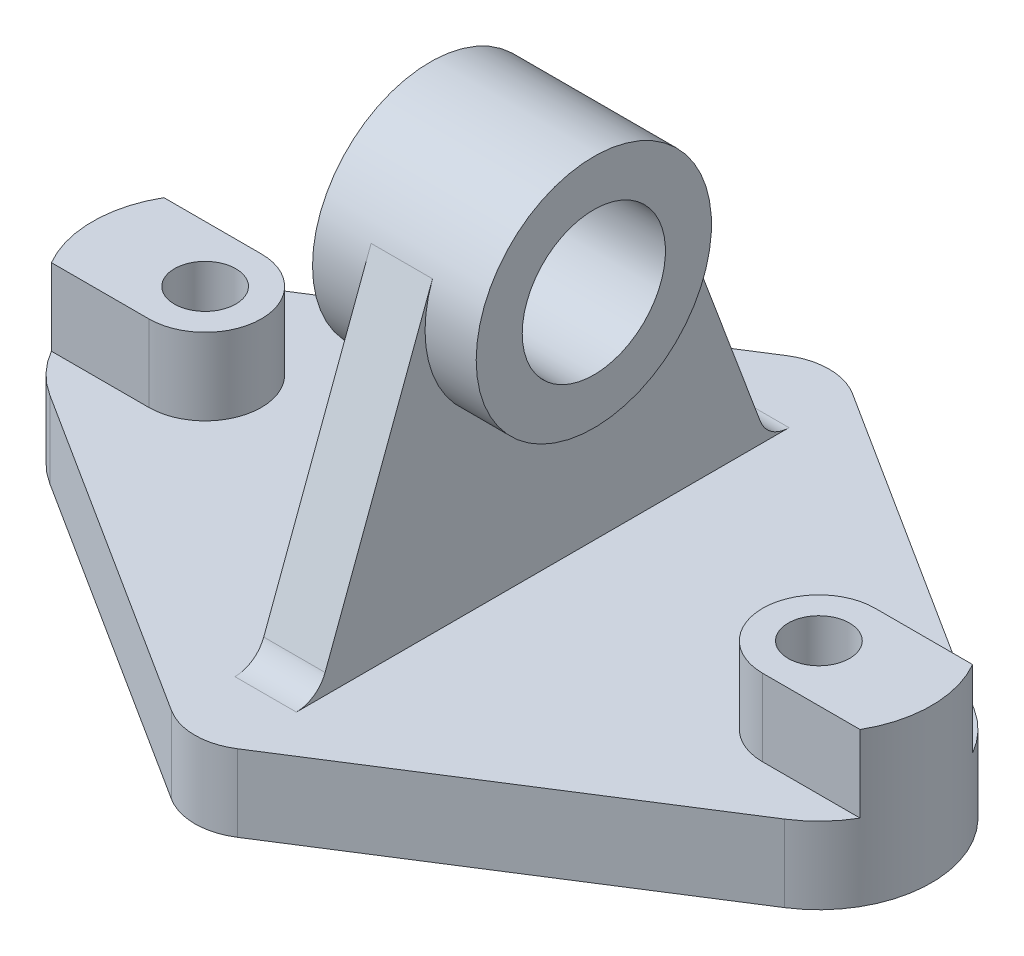
ISO-10303-21;
HEADER;
FILE_DESCRIPTION(('STEP AP214'),'2;1');
FILE_NAME('part.step','',(''),(''),'','','');
FILE_SCHEMA(('AUTOMOTIVE_DESIGN { 1 0 10303 214 1 1 1 1 }'));
ENDSEC;
DATA;
#1=APPLICATION_CONTEXT('core data for automotive mechanical design processes');
#2=APPLICATION_PROTOCOL_DEFINITION('international standard','automotive_design',2000,#1);
#3=PRODUCT_CONTEXT('',#1,'mechanical');
#4=PRODUCT('Part','Part','',(#3));
#5=PRODUCT_RELATED_PRODUCT_CATEGORY('part','',(#4));
#6=PRODUCT_DEFINITION_FORMATION('','',#4);
#7=PRODUCT_DEFINITION_CONTEXT('part definition',#1,'design');
#8=PRODUCT_DEFINITION('design','',#6,#7);
#9=PRODUCT_DEFINITION_SHAPE('','',#8);
#10=(LENGTH_UNIT() NAMED_UNIT(*) SI_UNIT(.MILLI.,.METRE.));
#11=(NAMED_UNIT(*) PLANE_ANGLE_UNIT() SI_UNIT($,.RADIAN.));
#12=(NAMED_UNIT(*) SI_UNIT($,.STERADIAN.) SOLID_ANGLE_UNIT());
#13=UNCERTAINTY_MEASURE_WITH_UNIT(LENGTH_MEASURE(1.E-05),#10,'distance_accuracy_value','');
#14=(GEOMETRIC_REPRESENTATION_CONTEXT(3) GLOBAL_UNCERTAINTY_ASSIGNED_CONTEXT((#13)) GLOBAL_UNIT_ASSIGNED_CONTEXT((#10,
#11,#12)) REPRESENTATION_CONTEXT('',''));
#15=CARTESIAN_POINT('',(0.,0.,0.));
#16=DIRECTION('',(0.,0.,1.));
#17=DIRECTION('',(1.,0.,0.));
#18=AXIS2_PLACEMENT_3D('',#15,#16,#17);
#19=CARTESIAN_POINT('',(60.,30.,0.));
#20=DIRECTION('',(0.,-1.,0.));
#21=DIRECTION('',(0.,0.,-1.));
#22=AXIS2_PLACEMENT_3D('',#19,#20,#21);
#23=CYLINDRICAL_SURFACE('',#22,11.);
#24=DIRECTION('',(0.,-1.,0.));
#25=VECTOR('',#24,1.);
#26=CARTESIAN_POINT('',(60.,30.,-11.));
#27=LINE('',#26,#25);
#28=CARTESIAN_POINT('',(60.,30.,-11.));
#29=VERTEX_POINT('',#28);
#30=CARTESIAN_POINT('',(60.,15.,-11.));
#31=VERTEX_POINT('',#30);
#32=EDGE_CURVE('E358',#29,#31,#27,.T.);
#33=ORIENTED_EDGE('',*,*,#32,.T.);
#34=CARTESIAN_POINT('',(60.,15.,0.));
#35=DIRECTION('',(0.,1.,0.));
#36=DIRECTION('',(0.,0.,1.));
#37=AXIS2_PLACEMENT_3D('',#34,#35,#36);
#38=CIRCLE('',#37,11.);
#39=CARTESIAN_POINT('',(60.,15.,11.));
#40=VERTEX_POINT('',#39);
#41=EDGE_CURVE('E313',#31,#40,#38,.T.);
#42=ORIENTED_EDGE('',*,*,#41,.T.);
#43=DIRECTION('',(0.,-1.,0.));
#44=VECTOR('',#43,1.);
#45=CARTESIAN_POINT('',(60.,30.,11.));
#46=LINE('',#45,#44);
#47=CARTESIAN_POINT('',(60.,30.,11.));
#48=VERTEX_POINT('',#47);
#49=EDGE_CURVE('E370',#48,#40,#46,.T.);
#50=ORIENTED_EDGE('',*,*,#49,.F.);
#51=CARTESIAN_POINT('',(60.,30.,0.));
#52=DIRECTION('',(0.,1.,0.));
#53=DIRECTION('',(0.,0.,1.));
#54=AXIS2_PLACEMENT_3D('',#51,#52,#53);
#55=CIRCLE('',#54,11.);
#56=EDGE_CURVE('E347',#29,#48,#55,.T.);
#57=ORIENTED_EDGE('',*,*,#56,.F.);
#58=EDGE_LOOP('',(#33,#42,#50,#57));
#59=FACE_BOUND('',#58,.T.);
#60=ADVANCED_FACE('F40',(#59),#23,.T.);
#61=CARTESIAN_POINT('',(0.,30.,11.));
#62=DIRECTION('',(0.,0.,-1.));
#63=DIRECTION('',(-1.,0.,0.));
#64=AXIS2_PLACEMENT_3D('',#61,#62,#63);
#65=PLANE('',#64);
#66=ORIENTED_EDGE('',*,*,#49,.T.);
#67=DIRECTION('',(1.,0.,0.));
#68=VECTOR('',#67,1.);
#69=CARTESIAN_POINT('',(0.,15.,11.));
#70=LINE('',#69,#68);
#71=CARTESIAN_POINT('',(79.0525588832577,15.,11.));
#72=VERTEX_POINT('',#71);
#73=EDGE_CURVE('E310',#40,#72,#70,.T.);
#74=ORIENTED_EDGE('',*,*,#73,.T.);
#75=DIRECTION('',(0.,-1.,0.));
#76=VECTOR('',#75,1.);
#77=CARTESIAN_POINT('',(79.0525588832577,30.,11.));
#78=LINE('',#77,#76);
#79=CARTESIAN_POINT('',(79.0525588832577,30.,11.));
#80=VERTEX_POINT('',#79);
#81=EDGE_CURVE('E367',#80,#72,#78,.T.);
#82=ORIENTED_EDGE('',*,*,#81,.F.);
#83=DIRECTION('',(1.,0.,0.));
#84=VECTOR('',#83,1.);
#85=CARTESIAN_POINT('',(0.,30.,11.));
#86=LINE('',#85,#84);
#87=EDGE_CURVE('E351',#48,#80,#86,.T.);
#88=ORIENTED_EDGE('',*,*,#87,.F.);
#89=EDGE_LOOP('',(#66,#74,#82,#88));
#90=FACE_BOUND('',#89,.T.);
#91=ADVANCED_FACE('F417',(#90),#65,.F.);
#92=CARTESIAN_POINT('',(60.,30.,0.));
#93=DIRECTION('',(0.,-1.,0.));
#94=DIRECTION('',(0.,0.,-1.));
#95=AXIS2_PLACEMENT_3D('',#92,#93,#94);
#96=CYLINDRICAL_SURFACE('',#95,22.);
#97=CARTESIAN_POINT('',(60.,0.,0.));
#98=DIRECTION('',(0.,1.,0.));
#99=DIRECTION('',(0.,0.,1.));
#100=AXIS2_PLACEMENT_3D('',#97,#98,#99);
#101=CIRCLE('',#100,22.);
#102=CARTESIAN_POINT('',(71.8042022322235,0.,18.5650426786682));
#103=VERTEX_POINT('',#102);
#104=CARTESIAN_POINT('',(71.8042022322235,0.,-18.5650426786682));
#105=VERTEX_POINT('',#104);
#106=EDGE_CURVE('E348',#103,#105,#101,.T.);
#107=ORIENTED_EDGE('',*,*,#106,.T.);
#108=DIRECTION('',(0.,-1.,0.));
#109=VECTOR('',#108,1.);
#110=CARTESIAN_POINT('',(71.8042022322235,15.,-18.5650426786682));
#111=LINE('',#110,#109);
#112=CARTESIAN_POINT('',(71.8042022322235,15.,-18.5650426786682));
#113=VERTEX_POINT('',#112);
#114=EDGE_CURVE('E335',#113,#105,#111,.T.);
#115=ORIENTED_EDGE('',*,*,#114,.F.);
#116=CARTESIAN_POINT('',(60.,15.,0.));
#117=DIRECTION('',(0.,1.,0.));
#118=DIRECTION('',(0.,0.,1.));
#119=AXIS2_PLACEMENT_3D('',#116,#117,#118);
#120=CIRCLE('',#119,22.);
#121=CARTESIAN_POINT('',(79.0525588832577,15.,-11.));
#122=VERTEX_POINT('',#121);
#123=EDGE_CURVE('E318',#122,#113,#120,.T.);
#124=ORIENTED_EDGE('',*,*,#123,.F.);
#125=DIRECTION('',(0.,-1.,0.));
#126=VECTOR('',#125,1.);
#127=CARTESIAN_POINT('',(79.0525588832577,30.,-11.));
#128=LINE('',#127,#126);
#129=CARTESIAN_POINT('',(79.0525588832577,30.,-11.));
#130=VERTEX_POINT('',#129);
#131=EDGE_CURVE('E364',#130,#122,#128,.T.);
#132=ORIENTED_EDGE('',*,*,#131,.F.);
#133=CARTESIAN_POINT('',(60.,30.,0.));
#134=DIRECTION('',(0.,1.,0.));
#135=DIRECTION('',(0.,0.,1.));
#136=AXIS2_PLACEMENT_3D('',#133,#134,#135);
#137=CIRCLE('',#136,22.);
#138=EDGE_CURVE('E353',#80,#130,#137,.T.);
#139=ORIENTED_EDGE('',*,*,#138,.F.);
#140=ORIENTED_EDGE('',*,*,#81,.T.);
#141=CARTESIAN_POINT('',(60.,15.,0.));
#142=DIRECTION('',(0.,1.,0.));
#143=DIRECTION('',(0.,0.,1.));
#144=AXIS2_PLACEMENT_3D('',#141,#142,#143);
#145=CIRCLE('',#144,22.);
#146=CARTESIAN_POINT('',(71.8042022322235,15.,18.5650426786682));
#147=VERTEX_POINT('',#146);
#148=EDGE_CURVE('E308',#147,#72,#145,.T.);
#149=ORIENTED_EDGE('',*,*,#148,.F.);
#150=DIRECTION('',(0.,-1.,0.));
#151=VECTOR('',#150,1.);
#152=CARTESIAN_POINT('',(71.8042022322235,15.,18.5650426786682));
#153=LINE('',#152,#151);
#154=EDGE_CURVE('E338',#147,#103,#153,.T.);
#155=ORIENTED_EDGE('',*,*,#154,.T.);
#156=EDGE_LOOP('',(#107,#115,#124,#132,#139,#140,#149,#155));
#157=FACE_BOUND('',#156,.T.);
#158=ADVANCED_FACE('F424',(#157),#96,.T.);
#159=CARTESIAN_POINT('',(60.,30.,0.));
#160=DIRECTION('',(0.,-1.,0.));
#161=DIRECTION('',(0.,0.,-1.));
#162=AXIS2_PLACEMENT_3D('',#159,#160,#161);
#163=CYLINDRICAL_SURFACE('',#162,5.99999999999999);
#164=CARTESIAN_POINT('',(60.,30.,0.));
#165=DIRECTION('',(0.,1.,0.));
#166=DIRECTION('',(0.,0.,1.));
#167=AXIS2_PLACEMENT_3D('',#164,#165,#166);
#168=CIRCLE('',#167,5.99999999999999);
#169=CARTESIAN_POINT('',(60.,30.,5.99999999999999));
#170=VERTEX_POINT('',#169);
#171=EDGE_CURVE('E344',#170,#170,#168,.T.);
#172=ORIENTED_EDGE('',*,*,#171,.T.);
#173=EDGE_LOOP('',(#172));
#174=FACE_BOUND('',#173,.T.);
#175=CARTESIAN_POINT('',(60.,0.,0.));
#176=DIRECTION('',(0.,1.,0.));
#177=DIRECTION('',(0.,0.,1.));
#178=AXIS2_PLACEMENT_3D('',#175,#176,#177);
#179=CIRCLE('',#178,5.99999999999999);
#180=CARTESIAN_POINT('',(60.,0.,5.99999999999999));
#181=VERTEX_POINT('',#180);
#182=EDGE_CURVE('E343',#181,#181,#179,.T.);
#183=ORIENTED_EDGE('',*,*,#182,.F.);
#184=EDGE_LOOP('',(#183));
#185=FACE_BOUND('',#184,.T.);
#186=ADVANCED_FACE('F429',(#174,#185),#163,.F.);
#187=CARTESIAN_POINT('',(0.,30.,-11.));
#188=DIRECTION('',(0.,0.,-1.));
#189=DIRECTION('',(-1.,0.,0.));
#190=AXIS2_PLACEMENT_3D('',#187,#188,#189);
#191=PLANE('',#190);
#192=DIRECTION('',(1.,0.,0.));
#193=VECTOR('',#192,1.);
#194=CARTESIAN_POINT('',(0.,15.,-11.));
#195=LINE('',#194,#193);
#196=EDGE_CURVE('E316',#31,#122,#195,.T.);
#197=ORIENTED_EDGE('',*,*,#196,.F.);
#198=ORIENTED_EDGE('',*,*,#32,.F.);
#199=DIRECTION('',(1.,0.,0.));
#200=VECTOR('',#199,1.);
#201=CARTESIAN_POINT('',(0.,30.,-11.));
#202=LINE('',#201,#200);
#203=EDGE_CURVE('E355',#29,#130,#202,.T.);
#204=ORIENTED_EDGE('',*,*,#203,.T.);
#205=ORIENTED_EDGE('',*,*,#131,.T.);
#206=EDGE_LOOP('',(#197,#198,#204,#205));
#207=FACE_BOUND('',#206,.T.);
#208=ADVANCED_FACE('F431',(#207),#191,.T.);
#209=CARTESIAN_POINT('',(0.,30.,0.));
#210=DIRECTION('',(0.,1.,0.));
#211=DIRECTION('',(0.,0.,1.));
#212=AXIS2_PLACEMENT_3D('',#209,#210,#211);
#213=PLANE('',#212);
#214=ORIENTED_EDGE('',*,*,#171,.F.);
#215=EDGE_LOOP('',(#214));
#216=FACE_BOUND('',#215,.T.);
#217=ORIENTED_EDGE('',*,*,#56,.T.);
#218=ORIENTED_EDGE('',*,*,#87,.T.);
#219=ORIENTED_EDGE('',*,*,#138,.T.);
#220=ORIENTED_EDGE('',*,*,#203,.F.);
#221=EDGE_LOOP('',(#217,#218,#219,#220));
#222=FACE_BOUND('',#221,.T.);
#223=ADVANCED_FACE('F475',(#216,#222),#213,.T.);
#224=CARTESIAN_POINT('',(0.,0.,0.));
#225=DIRECTION('',(0.,1.,0.));
#226=DIRECTION('',(0.,0.,1.));
#227=AXIS2_PLACEMENT_3D('',#224,#225,#226);
#228=PLANE('',#227);
#229=ORIENTED_EDGE('',*,*,#106,.F.);
#230=DIRECTION('',(0.843865576303099,0.,-0.536554646919249));
#231=VECTOR('',#230,1.);
#232=CARTESIAN_POINT('',(29.0776555800618,0.,45.7318424591052));
#233=LINE('',#232,#231);
#234=CARTESIAN_POINT('',(6.43865576303098,0.,60.1263869156372));
#235=VERTEX_POINT('',#234);
#236=EDGE_CURVE('E327',#235,#103,#233,.T.);
#237=ORIENTED_EDGE('',*,*,#236,.F.);
#238=CARTESIAN_POINT('',(0.,0.,50.));
#239=DIRECTION('',(0.,1.,0.));
#240=DIRECTION('',(0.,0.,1.));
#241=AXIS2_PLACEMENT_3D('',#238,#239,#240);
#242=CIRCLE('',#241,12.);
#243=CARTESIAN_POINT('',(-6.43865576303098,0.,60.1263869156372));
#244=VERTEX_POINT('',#243);
#245=EDGE_CURVE('E201',#235,#244,#242,.F.);
#246=ORIENTED_EDGE('',*,*,#245,.T.);
#247=DIRECTION('',(-0.843865576303099,0.,-0.536554646919249));
#248=VECTOR('',#247,1.);
#249=CARTESIAN_POINT('',(-29.0776555800618,0.,45.7318424591052));
#250=LINE('',#249,#248);
#251=CARTESIAN_POINT('',(-71.8042022322235,0.,18.5650426786682));
#252=VERTEX_POINT('',#251);
#253=EDGE_CURVE('E217',#244,#252,#250,.T.);
#254=ORIENTED_EDGE('',*,*,#253,.T.);
#255=CARTESIAN_POINT('',(-60.,0.,0.));
#256=DIRECTION('',(0.,-1.,0.));
#257=DIRECTION('',(0.,0.,1.));
#258=AXIS2_PLACEMENT_3D('',#255,#256,#257);
#259=CIRCLE('',#258,22.);
#260=CARTESIAN_POINT('',(-71.8042022322235,0.,-18.5650426786682));
#261=VERTEX_POINT('',#260);
#262=EDGE_CURVE('E258',#252,#261,#259,.T.);
#263=ORIENTED_EDGE('',*,*,#262,.T.);
#264=DIRECTION('',(-0.843865576303099,0.,0.536554646919249));
#265=VECTOR('',#264,1.);
#266=CARTESIAN_POINT('',(-29.0776555800618,0.,-45.7318424591052));
#267=LINE('',#266,#265);
#268=CARTESIAN_POINT('',(-6.43865576303098,0.,-60.1263869156372));
#269=VERTEX_POINT('',#268);
#270=EDGE_CURVE('E219',#269,#261,#267,.T.);
#271=ORIENTED_EDGE('',*,*,#270,.F.);
#272=CARTESIAN_POINT('',(0.,0.,-50.));
#273=DIRECTION('',(0.,1.,0.));
#274=DIRECTION('',(0.,0.,1.));
#275=AXIS2_PLACEMENT_3D('',#272,#273,#274);
#276=CIRCLE('',#275,12.);
#277=CARTESIAN_POINT('',(6.43865576303098,0.,-60.1263869156372));
#278=VERTEX_POINT('',#277);
#279=EDGE_CURVE('E306',#278,#269,#276,.T.);
#280=ORIENTED_EDGE('',*,*,#279,.F.);
#281=DIRECTION('',(0.843865576303099,0.,0.536554646919249));
#282=VECTOR('',#281,1.);
#283=CARTESIAN_POINT('',(29.0776555800618,0.,-45.7318424591052));
#284=LINE('',#283,#282);
#285=EDGE_CURVE('E330',#278,#105,#284,.T.);
#286=ORIENTED_EDGE('',*,*,#285,.T.);
#287=EDGE_LOOP('',(#229,#237,#246,#254,#263,#271,#280,#286));
#288=FACE_BOUND('',#287,.T.);
#289=ORIENTED_EDGE('',*,*,#182,.T.);
#290=EDGE_LOOP('',(#289));
#291=FACE_BOUND('',#290,.T.);
#292=CARTESIAN_POINT('',(-60.,0.,0.));
#293=DIRECTION('',(0.,-1.,0.));
#294=DIRECTION('',(0.,0.,1.));
#295=AXIS2_PLACEMENT_3D('',#292,#293,#294);
#296=CIRCLE('',#295,5.99999999999999);
#297=CARTESIAN_POINT('',(-60.,0.,5.99999999999999));
#298=VERTEX_POINT('',#297);
#299=EDGE_CURVE('E253',#298,#298,#296,.T.);
#300=ORIENTED_EDGE('',*,*,#299,.F.);
#301=EDGE_LOOP('',(#300));
#302=FACE_BOUND('',#301,.T.);
#303=ADVANCED_FACE('F473',(#288,#291,#302),#228,.F.);
#304=CARTESIAN_POINT('',(0.,15.,50.));
#305=DIRECTION('',(0.,-1.,0.));
#306=DIRECTION('',(0.,0.,-1.));
#307=AXIS2_PLACEMENT_3D('',#304,#305,#306);
#308=CYLINDRICAL_SURFACE('',#307,12.);
#309=ORIENTED_EDGE('',*,*,#245,.F.);
#310=DIRECTION('',(0.,-1.,0.));
#311=VECTOR('',#310,1.);
#312=CARTESIAN_POINT('',(6.43865576303098,15.,60.1263869156372));
#313=LINE('',#312,#311);
#314=CARTESIAN_POINT('',(6.43865576303098,15.,60.1263869156372));
#315=VERTEX_POINT('',#314);
#316=EDGE_CURVE('E341',#315,#235,#313,.T.);
#317=ORIENTED_EDGE('',*,*,#316,.F.);
#318=CARTESIAN_POINT('',(0.,15.,50.));
#319=DIRECTION('',(0.,1.,0.));
#320=DIRECTION('',(0.,0.,1.));
#321=AXIS2_PLACEMENT_3D('',#318,#319,#320);
#322=CIRCLE('',#321,12.);
#323=CARTESIAN_POINT('',(-6.43865576303098,15.,60.1263869156372));
#324=VERTEX_POINT('',#323);
#325=EDGE_CURVE('E303',#315,#324,#322,.F.);
#326=ORIENTED_EDGE('',*,*,#325,.T.);
#327=DIRECTION('',(0.,-1.,0.));
#328=VECTOR('',#327,1.);
#329=CARTESIAN_POINT('',(-6.43865576303098,15.,60.1263869156372));
#330=LINE('',#329,#328);
#331=EDGE_CURVE('E250',#324,#244,#330,.T.);
#332=ORIENTED_EDGE('',*,*,#331,.T.);
#333=EDGE_LOOP('',(#309,#317,#326,#332));
#334=FACE_BOUND('',#333,.T.);
#335=ADVANCED_FACE('F469',(#334),#308,.T.);
#336=CARTESIAN_POINT('',(29.0776555800618,15.,45.7318424591052));
#337=DIRECTION('',(-0.536554646919248,0.,-0.843865576303099));
#338=DIRECTION('',(-0.843865576303099,0.,0.536554646919248));
#339=AXIS2_PLACEMENT_3D('',#336,#337,#338);
#340=PLANE('',#339);
#341=ORIENTED_EDGE('',*,*,#236,.T.);
#342=ORIENTED_EDGE('',*,*,#154,.F.);
#343=DIRECTION('',(0.843865576303099,0.,-0.536554646919249));
#344=VECTOR('',#343,1.);
#345=CARTESIAN_POINT('',(29.0776555800618,15.,45.7318424591052));
#346=LINE('',#345,#344);
#347=EDGE_CURVE('E305',#315,#147,#346,.T.);
#348=ORIENTED_EDGE('',*,*,#347,.F.);
#349=ORIENTED_EDGE('',*,*,#316,.T.);
#350=EDGE_LOOP('',(#341,#342,#348,#349));
#351=FACE_BOUND('',#350,.T.);
#352=ADVANCED_FACE('F465',(#351),#340,.F.);
#353=CARTESIAN_POINT('',(29.0776555800618,15.,-45.7318424591052));
#354=DIRECTION('',(0.536554646919248,0.,-0.843865576303099));
#355=DIRECTION('',(-0.843865576303099,0.,-0.536554646919248));
#356=AXIS2_PLACEMENT_3D('',#353,#354,#355);
#357=PLANE('',#356);
#358=ORIENTED_EDGE('',*,*,#285,.F.);
#359=DIRECTION('',(0.,-1.,0.));
#360=VECTOR('',#359,1.);
#361=CARTESIAN_POINT('',(6.43865576303098,15.,-60.1263869156372));
#362=LINE('',#361,#360);
#363=CARTESIAN_POINT('',(6.43865576303098,15.,-60.1263869156372));
#364=VERTEX_POINT('',#363);
#365=EDGE_CURVE('E325',#364,#278,#362,.T.);
#366=ORIENTED_EDGE('',*,*,#365,.F.);
#367=DIRECTION('',(0.843865576303099,0.,0.536554646919249));
#368=VECTOR('',#367,1.);
#369=CARTESIAN_POINT('',(29.0776555800618,15.,-45.7318424591052));
#370=LINE('',#369,#368);
#371=EDGE_CURVE('E320',#364,#113,#370,.T.);
#372=ORIENTED_EDGE('',*,*,#371,.T.);
#373=ORIENTED_EDGE('',*,*,#114,.T.);
#374=EDGE_LOOP('',(#358,#366,#372,#373));
#375=FACE_BOUND('',#374,.T.);
#376=ADVANCED_FACE('F461',(#375),#357,.T.);
#377=CARTESIAN_POINT('',(0.,15.,-50.));
#378=DIRECTION('',(0.,-1.,0.));
#379=DIRECTION('',(0.,0.,-1.));
#380=AXIS2_PLACEMENT_3D('',#377,#378,#379);
#381=CYLINDRICAL_SURFACE('',#380,12.);
#382=ORIENTED_EDGE('',*,*,#279,.T.);
#383=DIRECTION('',(0.,-1.,0.));
#384=VECTOR('',#383,1.);
#385=CARTESIAN_POINT('',(-6.43865576303098,15.,-60.1263869156372));
#386=LINE('',#385,#384);
#387=CARTESIAN_POINT('',(-6.43865576303098,15.,-60.1263869156372));
#388=VERTEX_POINT('',#387);
#389=EDGE_CURVE('E239',#388,#269,#386,.T.);
#390=ORIENTED_EDGE('',*,*,#389,.F.);
#391=CARTESIAN_POINT('',(0.,15.,-50.));
#392=DIRECTION('',(0.,1.,0.));
#393=DIRECTION('',(0.,0.,1.));
#394=AXIS2_PLACEMENT_3D('',#391,#392,#393);
#395=CIRCLE('',#394,12.);
#396=EDGE_CURVE('E323',#364,#388,#395,.T.);
#397=ORIENTED_EDGE('',*,*,#396,.F.);
#398=ORIENTED_EDGE('',*,*,#365,.T.);
#399=EDGE_LOOP('',(#382,#390,#397,#398));
#400=FACE_BOUND('',#399,.T.);
#401=ADVANCED_FACE('F457',(#400),#381,.T.);
#402=CARTESIAN_POINT('',(0.,15.,0.));
#403=DIRECTION('',(0.,1.,0.));
#404=DIRECTION('',(0.,0.,1.));
#405=AXIS2_PLACEMENT_3D('',#402,#403,#404);
#406=PLANE('',#405);
#407=DIRECTION('',(-0.843865576303099,0.,-0.536554646919249));
#408=VECTOR('',#407,1.);
#409=CARTESIAN_POINT('',(-29.0776555800618,15.,45.7318424591052));
#410=LINE('',#409,#408);
#411=CARTESIAN_POINT('',(-71.8042022322235,15.,18.5650426786682));
#412=VERTEX_POINT('',#411);
#413=EDGE_CURVE('E223',#324,#412,#410,.T.);
#414=ORIENTED_EDGE('',*,*,#413,.F.);
#415=ORIENTED_EDGE('',*,*,#325,.F.);
#416=ORIENTED_EDGE('',*,*,#347,.T.);
#417=ORIENTED_EDGE('',*,*,#148,.T.);
#418=ORIENTED_EDGE('',*,*,#73,.F.);
#419=ORIENTED_EDGE('',*,*,#41,.F.);
#420=ORIENTED_EDGE('',*,*,#196,.T.);
#421=ORIENTED_EDGE('',*,*,#123,.T.);
#422=ORIENTED_EDGE('',*,*,#371,.F.);
#423=ORIENTED_EDGE('',*,*,#396,.T.);
#424=DIRECTION('',(-0.843865576303099,0.,0.536554646919249));
#425=VECTOR('',#424,1.);
#426=CARTESIAN_POINT('',(-29.0776555800618,15.,-45.7318424591052));
#427=LINE('',#426,#425);
#428=CARTESIAN_POINT('',(-71.8042022322235,15.,-18.5650426786682));
#429=VERTEX_POINT('',#428);
#430=EDGE_CURVE('E238',#388,#429,#427,.T.);
#431=ORIENTED_EDGE('',*,*,#430,.T.);
#432=CARTESIAN_POINT('',(-60.,15.,0.));
#433=DIRECTION('',(0.,-1.,0.));
#434=DIRECTION('',(0.,0.,1.));
#435=AXIS2_PLACEMENT_3D('',#432,#433,#434);
#436=CIRCLE('',#435,22.);
#437=CARTESIAN_POINT('',(-79.0525588832577,15.,-11.));
#438=VERTEX_POINT('',#437);
#439=EDGE_CURVE('E235',#438,#429,#436,.T.);
#440=ORIENTED_EDGE('',*,*,#439,.F.);
#441=DIRECTION('',(-1.,0.,0.));
#442=VECTOR('',#441,1.);
#443=CARTESIAN_POINT('',(0.,15.,-11.));
#444=LINE('',#443,#442);
#445=CARTESIAN_POINT('',(-60.,15.,-11.));
#446=VERTEX_POINT('',#445);
#447=EDGE_CURVE('E233',#446,#438,#444,.T.);
#448=ORIENTED_EDGE('',*,*,#447,.F.);
#449=CARTESIAN_POINT('',(-60.,15.,0.));
#450=DIRECTION('',(0.,-1.,0.));
#451=DIRECTION('',(0.,0.,1.));
#452=AXIS2_PLACEMENT_3D('',#449,#450,#451);
#453=CIRCLE('',#452,11.);
#454=CARTESIAN_POINT('',(-60.,15.,11.));
#455=VERTEX_POINT('',#454);
#456=EDGE_CURVE('E230',#446,#455,#453,.T.);
#457=ORIENTED_EDGE('',*,*,#456,.T.);
#458=DIRECTION('',(-1.,0.,0.));
#459=VECTOR('',#458,1.);
#460=CARTESIAN_POINT('',(0.,15.,11.));
#461=LINE('',#460,#459);
#462=CARTESIAN_POINT('',(-79.0525588832577,15.,11.));
#463=VERTEX_POINT('',#462);
#464=EDGE_CURVE('E227',#455,#463,#461,.T.);
#465=ORIENTED_EDGE('',*,*,#464,.T.);
#466=CARTESIAN_POINT('',(-60.,15.,0.));
#467=DIRECTION('',(0.,-1.,0.));
#468=DIRECTION('',(0.,0.,1.));
#469=AXIS2_PLACEMENT_3D('',#466,#467,#468);
#470=CIRCLE('',#469,22.);
#471=EDGE_CURVE('E225',#412,#463,#470,.T.);
#472=ORIENTED_EDGE('',*,*,#471,.F.);
#473=EDGE_LOOP('',(#414,#415,#416,#417,#418,#419,#420,#421,#422,#423,#431,#440,#448,#457,#465,#472));
#474=FACE_BOUND('',#473,.T.);
#475=DIRECTION('',(-1.,0.,0.));
#476=VECTOR('',#475,1.);
#477=CARTESIAN_POINT('',(0.,15.,48.1621545670983));
#478=LINE('',#477,#476);
#479=CARTESIAN_POINT('',(6.,15.,48.1621545670983));
#480=VERTEX_POINT('',#479);
#481=CARTESIAN_POINT('',(-6.,15.,48.1621545670983));
#482=VERTEX_POINT('',#481);
#483=EDGE_CURVE('E374',#480,#482,#478,.T.);
#484=ORIENTED_EDGE('',*,*,#483,.T.);
#485=DIRECTION('',(0.,0.,-1.));
#486=VECTOR('',#485,1.);
#487=CARTESIAN_POINT('',(-6.,15.,0.));
#488=LINE('',#487,#486);
#489=CARTESIAN_POINT('',(-6.,15.,-48.1621545670983));
#490=VERTEX_POINT('',#489);
#491=EDGE_CURVE('E383',#482,#490,#488,.T.);
#492=ORIENTED_EDGE('',*,*,#491,.T.);
#493=DIRECTION('',(-1.,0.,0.));
#494=VECTOR('',#493,1.);
#495=CARTESIAN_POINT('',(6.,15.,-48.1621545670983));
#496=LINE('',#495,#494);
#497=CARTESIAN_POINT('',(6.,15.,-48.1621545670983));
#498=VERTEX_POINT('',#497);
#499=EDGE_CURVE('E376',#490,#498,#496,.F.);
#500=ORIENTED_EDGE('',*,*,#499,.T.);
#501=DIRECTION('',(0.,0.,-1.));
#502=VECTOR('',#501,1.);
#503=CARTESIAN_POINT('',(6.,15.,0.));
#504=LINE('',#503,#502);
#505=EDGE_CURVE('E62',#480,#498,#504,.T.);
#506=ORIENTED_EDGE('',*,*,#505,.F.);
#507=EDGE_LOOP('',(#484,#492,#500,#506));
#508=FACE_BOUND('',#507,.T.);
#509=ADVANCED_FACE('F385',(#474,#508),#406,.T.);
#510=CARTESIAN_POINT('',(6.,16.2748516485556,-43.5232892129861));
#511=DIRECTION('',(0.,0.350248176279361,-0.936656935602882));
#512=DIRECTION('',(0.,0.936656935602882,0.350248176279361));
#513=AXIS2_PLACEMENT_3D('',#510,#511,#512);
#514=PLANE('',#513);
#515=DIRECTION('',(0.,-0.936656935602882,-0.350248176279361));
#516=VECTOR('',#515,1.);
#517=CARTESIAN_POINT('',(6.,16.2748516485556,-43.5232892129861));
#518=LINE('',#517,#516);
#519=CARTESIAN_POINT('',(6.,75.0557080544253,-21.5431095188663));
#520=VERTEX_POINT('',#519);
#521=CARTESIAN_POINT('',(6.,18.8985109423238,-42.542212953481));
#522=VERTEX_POINT('',#521);
#523=EDGE_CURVE('E300',#520,#522,#518,.T.);
#524=ORIENTED_EDGE('',*,*,#523,.T.);
#525=DIRECTION('',(-1.,0.,0.));
#526=VECTOR('',#525,1.);
#527=CARTESIAN_POINT('',(0.,18.8985109423238,-42.542212953481));
#528=LINE('',#527,#526);
#529=CARTESIAN_POINT('',(-6.,18.8985109423238,-42.542212953481));
#530=VERTEX_POINT('',#529);
#531=EDGE_CURVE('E215',#522,#530,#528,.T.);
#532=ORIENTED_EDGE('',*,*,#531,.T.);
#533=DIRECTION('',(0.,-0.936656935602882,-0.350248176279361));
#534=VECTOR('',#533,1.);
#535=CARTESIAN_POINT('',(-6.,16.2748516485556,-43.5232892129861));
#536=LINE('',#535,#534);
#537=CARTESIAN_POINT('',(-6.,75.0557080544253,-21.5431095188663));
#538=VERTEX_POINT('',#537);
#539=EDGE_CURVE('E209',#538,#530,#536,.T.);
#540=ORIENTED_EDGE('',*,*,#539,.F.);
#541=DIRECTION('',(-1.,0.,0.));
#542=VECTOR('',#541,1.);
#543=CARTESIAN_POINT('',(6.,75.0557080544253,-21.5431095188663));
#544=LINE('',#543,#542);
#545=EDGE_CURVE('E189',#520,#538,#544,.T.);
#546=ORIENTED_EDGE('',*,*,#545,.F.);
#547=EDGE_LOOP('',(#524,#532,#540,#546));
#548=FACE_BOUND('',#547,.T.);
#549=ADVANCED_FACE('F213',(#548),#514,.T.);
#550=CARTESIAN_POINT('',(6.,16.2748516485556,43.5232892129861));
#551=DIRECTION('',(0.,-0.350248176279361,-0.936656935602882));
#552=DIRECTION('',(0.,0.936656935602882,-0.350248176279361));
#553=AXIS2_PLACEMENT_3D('',#550,#551,#552);
#554=PLANE('',#553);
#555=DIRECTION('',(-1.,0.,0.));
#556=VECTOR('',#555,1.);
#557=CARTESIAN_POINT('',(6.,75.0557080544253,21.5431095188663));
#558=LINE('',#557,#556);
#559=CARTESIAN_POINT('',(6.,75.0557080544253,21.5431095188663));
#560=VERTEX_POINT('',#559);
#561=CARTESIAN_POINT('',(-6.,75.0557080544253,21.5431095188663));
#562=VERTEX_POINT('',#561);
#563=EDGE_CURVE('E202',#560,#562,#558,.T.);
#564=ORIENTED_EDGE('',*,*,#563,.T.);
#565=DIRECTION('',(0.,-0.936656935602882,0.350248176279361));
#566=VECTOR('',#565,1.);
#567=CARTESIAN_POINT('',(-6.,16.2748516485556,43.5232892129861));
#568=LINE('',#567,#566);
#569=CARTESIAN_POINT('',(-6.,18.8985109423238,42.542212953481));
#570=VERTEX_POINT('',#569);
#571=EDGE_CURVE('E211',#562,#570,#568,.T.);
#572=ORIENTED_EDGE('',*,*,#571,.T.);
#573=DIRECTION('',(-1.,0.,0.));
#574=VECTOR('',#573,1.);
#575=CARTESIAN_POINT('',(6.,18.8985109423238,42.542212953481));
#576=LINE('',#575,#574);
#577=CARTESIAN_POINT('',(6.,18.8985109423238,42.542212953481));
#578=VERTEX_POINT('',#577);
#579=EDGE_CURVE('E55',#570,#578,#576,.F.);
#580=ORIENTED_EDGE('',*,*,#579,.T.);
#581=DIRECTION('',(0.,-0.936656935602882,0.350248176279361));
#582=VECTOR('',#581,1.);
#583=CARTESIAN_POINT('',(6.,16.2748516485556,43.5232892129861));
#584=LINE('',#583,#582);
#585=EDGE_CURVE('E297',#560,#578,#584,.T.);
#586=ORIENTED_EDGE('',*,*,#585,.F.);
#587=EDGE_LOOP('',(#564,#572,#580,#586));
#588=FACE_BOUND('',#587,.T.);
#589=ADVANCED_FACE('F445',(#588),#554,.F.);
#590=CARTESIAN_POINT('',(6.,0.,0.));
#591=DIRECTION('',(-1.,0.,0.));
#592=DIRECTION('',(0.,0.,1.));
#593=AXIS2_PLACEMENT_3D('',#590,#591,#592);
#594=PLANE('',#593);
#595=ORIENTED_EDGE('',*,*,#505,.T.);
#596=CARTESIAN_POINT('',(6.,21.,-48.1621545670983));
#597=DIRECTION('',(-1.,0.,0.));
#598=DIRECTION('',(0.,0.,1.));
#599=AXIS2_PLACEMENT_3D('',#596,#597,#598);
#600=CIRCLE('',#599,6.);
#601=EDGE_CURVE('E48',#498,#522,#600,.T.);
#602=ORIENTED_EDGE('',*,*,#601,.T.);
#603=ORIENTED_EDGE('',*,*,#523,.F.);
#604=CARTESIAN_POINT('',(6.,67.,0.));
#605=DIRECTION('',(-1.,0.,0.));
#606=DIRECTION('',(0.,0.,1.));
#607=AXIS2_PLACEMENT_3D('',#604,#605,#606);
#608=CIRCLE('',#607,23.);
#609=EDGE_CURVE('E196',#520,#560,#608,.T.);
#610=ORIENTED_EDGE('',*,*,#609,.T.);
#611=ORIENTED_EDGE('',*,*,#585,.T.);
#612=CARTESIAN_POINT('',(6.,21.,48.1621545670983));
#613=DIRECTION('',(-1.,0.,0.));
#614=DIRECTION('',(0.,0.,1.));
#615=AXIS2_PLACEMENT_3D('',#612,#613,#614);
#616=CIRCLE('',#615,6.);
#617=EDGE_CURVE('E11',#578,#480,#616,.T.);
#618=ORIENTED_EDGE('',*,*,#617,.T.);
#619=EDGE_LOOP('',(#595,#602,#603,#610,#611,#618));
#620=FACE_BOUND('',#619,.T.);
#621=ADVANCED_FACE('F379',(#620),#594,.F.);
#622=CARTESIAN_POINT('',(16.,67.,0.));
#623=DIRECTION('',(-1.,0.,0.));
#624=DIRECTION('',(0.,0.,1.));
#625=AXIS2_PLACEMENT_3D('',#622,#623,#624);
#626=CYLINDRICAL_SURFACE('',#625,14.);
#627=CARTESIAN_POINT('',(16.,67.,0.));
#628=DIRECTION('',(-1.,0.,0.));
#629=DIRECTION('',(0.,0.,1.));
#630=AXIS2_PLACEMENT_3D('',#627,#628,#629);
#631=CIRCLE('',#630,14.);
#632=CARTESIAN_POINT('',(16.,67.,14.));
#633=VERTEX_POINT('',#632);
#634=EDGE_CURVE('E290',#633,#633,#631,.T.);
#635=ORIENTED_EDGE('',*,*,#634,.F.);
#636=EDGE_LOOP('',(#635));
#637=FACE_BOUND('',#636,.T.);
#638=CARTESIAN_POINT('',(-16.,67.,0.));
#639=DIRECTION('',(-1.,0.,0.));
#640=DIRECTION('',(0.,0.,1.));
#641=AXIS2_PLACEMENT_3D('',#638,#639,#640);
#642=CIRCLE('',#641,14.);
#643=CARTESIAN_POINT('',(-16.,67.,14.));
#644=VERTEX_POINT('',#643);
#645=EDGE_CURVE('E390',#644,#644,#642,.T.);
#646=ORIENTED_EDGE('',*,*,#645,.T.);
#647=EDGE_LOOP('',(#646));
#648=FACE_BOUND('',#647,.T.);
#649=ADVANCED_FACE('F396',(#637,#648),#626,.F.);
#650=CARTESIAN_POINT('',(16.,67.,0.));
#651=DIRECTION('',(-1.,0.,0.));
#652=DIRECTION('',(0.,0.,1.));
#653=AXIS2_PLACEMENT_3D('',#650,#651,#652);
#654=CYLINDRICAL_SURFACE('',#653,23.);
#655=ORIENTED_EDGE('',*,*,#609,.F.);
#656=ORIENTED_EDGE('',*,*,#545,.T.);
#657=CARTESIAN_POINT('',(-6.,67.,0.));
#658=DIRECTION('',(-1.,0.,0.));
#659=DIRECTION('',(0.,0.,1.));
#660=AXIS2_PLACEMENT_3D('',#657,#658,#659);
#661=CIRCLE('',#660,23.);
#662=EDGE_CURVE('E193',#538,#562,#661,.T.);
#663=ORIENTED_EDGE('',*,*,#662,.T.);
#664=ORIENTED_EDGE('',*,*,#563,.F.);
#665=EDGE_LOOP('',(#655,#656,#663,#664));
#666=FACE_BOUND('',#665,.T.);
#667=CARTESIAN_POINT('',(16.,67.,0.));
#668=DIRECTION('',(-1.,0.,0.));
#669=DIRECTION('',(0.,0.,1.));
#670=AXIS2_PLACEMENT_3D('',#667,#668,#669);
#671=CIRCLE('',#670,23.);
#672=CARTESIAN_POINT('',(16.,67.,23.));
#673=VERTEX_POINT('',#672);
#674=EDGE_CURVE('E293',#673,#673,#671,.T.);
#675=ORIENTED_EDGE('',*,*,#674,.T.);
#676=EDGE_LOOP('',(#675));
#677=FACE_BOUND('',#676,.T.);
#678=CARTESIAN_POINT('',(-16.,67.,0.));
#679=DIRECTION('',(-1.,0.,0.));
#680=DIRECTION('',(0.,0.,1.));
#681=AXIS2_PLACEMENT_3D('',#678,#679,#680);
#682=CIRCLE('',#681,23.);
#683=CARTESIAN_POINT('',(-16.,67.,23.));
#684=VERTEX_POINT('',#683);
#685=EDGE_CURVE('E387',#684,#684,#682,.T.);
#686=ORIENTED_EDGE('',*,*,#685,.F.);
#687=EDGE_LOOP('',(#686));
#688=FACE_BOUND('',#687,.T.);
#689=ADVANCED_FACE('F191',(#666,#677,#688),#654,.T.);
#690=CARTESIAN_POINT('',(16.,0.,0.));
#691=DIRECTION('',(-1.,0.,0.));
#692=DIRECTION('',(0.,0.,1.));
#693=AXIS2_PLACEMENT_3D('',#690,#691,#692);
#694=PLANE('',#693);
#695=ORIENTED_EDGE('',*,*,#634,.T.);
#696=EDGE_LOOP('',(#695));
#697=FACE_BOUND('',#696,.T.);
#698=ORIENTED_EDGE('',*,*,#674,.F.);
#699=EDGE_LOOP('',(#698));
#700=FACE_BOUND('',#699,.T.);
#701=ADVANCED_FACE('F405',(#697,#700),#694,.F.);
#702=CARTESIAN_POINT('',(6.,21.,-48.1621545670983));
#703=DIRECTION('',(1.,0.,0.));
#704=DIRECTION('',(0.,0.,-1.));
#705=AXIS2_PLACEMENT_3D('',#702,#703,#704);
#706=CYLINDRICAL_SURFACE('',#705,6.);
#707=ORIENTED_EDGE('',*,*,#601,.F.);
#708=ORIENTED_EDGE('',*,*,#499,.F.);
#709=CARTESIAN_POINT('',(-6.,21.,-48.1621545670983));
#710=DIRECTION('',(-1.,0.,0.));
#711=DIRECTION('',(0.,0.,1.));
#712=AXIS2_PLACEMENT_3D('',#709,#710,#711);
#713=CIRCLE('',#712,6.);
#714=EDGE_CURVE('E285',#490,#530,#713,.T.);
#715=ORIENTED_EDGE('',*,*,#714,.T.);
#716=ORIENTED_EDGE('',*,*,#531,.F.);
#717=EDGE_LOOP('',(#707,#708,#715,#716));
#718=FACE_BOUND('',#717,.T.);
#719=ADVANCED_FACE('F381',(#718),#706,.F.);
#720=CARTESIAN_POINT('',(0.,21.,48.1621545670983));
#721=DIRECTION('',(-1.,0.,0.));
#722=DIRECTION('',(0.,0.,1.));
#723=AXIS2_PLACEMENT_3D('',#720,#721,#722);
#724=CYLINDRICAL_SURFACE('',#723,6.);
#725=ORIENTED_EDGE('',*,*,#617,.F.);
#726=ORIENTED_EDGE('',*,*,#579,.F.);
#727=CARTESIAN_POINT('',(-6.,21.,48.1621545670983));
#728=DIRECTION('',(-1.,0.,0.));
#729=DIRECTION('',(0.,0.,1.));
#730=AXIS2_PLACEMENT_3D('',#727,#728,#729);
#731=CIRCLE('',#730,6.);
#732=EDGE_CURVE('E287',#570,#482,#731,.T.);
#733=ORIENTED_EDGE('',*,*,#732,.T.);
#734=ORIENTED_EDGE('',*,*,#483,.F.);
#735=EDGE_LOOP('',(#725,#726,#733,#734));
#736=FACE_BOUND('',#735,.T.);
#737=ADVANCED_FACE('F42',(#736),#724,.F.);
#738=CARTESIAN_POINT('',(-60.,30.,0.));
#739=DIRECTION('',(0.,-1.,0.));
#740=DIRECTION('',(0.,0.,-1.));
#741=AXIS2_PLACEMENT_3D('',#738,#739,#740);
#742=CYLINDRICAL_SURFACE('',#741,11.);
#743=DIRECTION('',(0.,-1.,0.));
#744=VECTOR('',#743,1.);
#745=CARTESIAN_POINT('',(-60.,30.,-11.));
#746=LINE('',#745,#744);
#747=CARTESIAN_POINT('',(-60.,30.,-11.));
#748=VERTEX_POINT('',#747);
#749=EDGE_CURVE('E269',#748,#446,#746,.T.);
#750=ORIENTED_EDGE('',*,*,#749,.F.);
#751=CARTESIAN_POINT('',(-60.,30.,0.));
#752=DIRECTION('',(0.,-1.,0.));
#753=DIRECTION('',(0.,0.,1.));
#754=AXIS2_PLACEMENT_3D('',#751,#752,#753);
#755=CIRCLE('',#754,11.);
#756=CARTESIAN_POINT('',(-60.,30.,11.));
#757=VERTEX_POINT('',#756);
#758=EDGE_CURVE('E257',#748,#757,#755,.T.);
#759=ORIENTED_EDGE('',*,*,#758,.T.);
#760=DIRECTION('',(0.,-1.,0.));
#761=VECTOR('',#760,1.);
#762=CARTESIAN_POINT('',(-60.,30.,11.));
#763=LINE('',#762,#761);
#764=EDGE_CURVE('E282',#757,#455,#763,.T.);
#765=ORIENTED_EDGE('',*,*,#764,.T.);
#766=ORIENTED_EDGE('',*,*,#456,.F.);
#767=EDGE_LOOP('',(#750,#759,#765,#766));
#768=FACE_BOUND('',#767,.T.);
#769=ADVANCED_FACE('F436',(#768),#742,.T.);
#770=CARTESIAN_POINT('',(0.,30.,11.));
#771=DIRECTION('',(0.,0.,-1.));
#772=DIRECTION('',(1.,0.,0.));
#773=AXIS2_PLACEMENT_3D('',#770,#771,#772);
#774=PLANE('',#773);
#775=ORIENTED_EDGE('',*,*,#764,.F.);
#776=DIRECTION('',(-1.,0.,0.));
#777=VECTOR('',#776,1.);
#778=CARTESIAN_POINT('',(0.,30.,11.));
#779=LINE('',#778,#777);
#780=CARTESIAN_POINT('',(-79.0525588832577,30.,11.));
#781=VERTEX_POINT('',#780);
#782=EDGE_CURVE('E261',#757,#781,#779,.T.);
#783=ORIENTED_EDGE('',*,*,#782,.T.);
#784=DIRECTION('',(0.,-1.,0.));
#785=VECTOR('',#784,1.);
#786=CARTESIAN_POINT('',(-79.0525588832577,30.,11.));
#787=LINE('',#786,#785);
#788=EDGE_CURVE('E279',#781,#463,#787,.T.);
#789=ORIENTED_EDGE('',*,*,#788,.T.);
#790=ORIENTED_EDGE('',*,*,#464,.F.);
#791=EDGE_LOOP('',(#775,#783,#789,#790));
#792=FACE_BOUND('',#791,.T.);
#793=ADVANCED_FACE('F441',(#792),#774,.F.);
#794=CARTESIAN_POINT('',(-60.,30.,0.));
#795=DIRECTION('',(0.,-1.,0.));
#796=DIRECTION('',(0.,0.,-1.));
#797=AXIS2_PLACEMENT_3D('',#794,#795,#796);
#798=CYLINDRICAL_SURFACE('',#797,22.);
#799=ORIENTED_EDGE('',*,*,#262,.F.);
#800=DIRECTION('',(0.,-1.,0.));
#801=VECTOR('',#800,1.);
#802=CARTESIAN_POINT('',(-71.8042022322235,15.,18.5650426786682));
#803=LINE('',#802,#801);
#804=EDGE_CURVE('E247',#412,#252,#803,.T.);
#805=ORIENTED_EDGE('',*,*,#804,.F.);
#806=ORIENTED_EDGE('',*,*,#471,.T.);
#807=ORIENTED_EDGE('',*,*,#788,.F.);
#808=CARTESIAN_POINT('',(-60.,30.,0.));
#809=DIRECTION('',(0.,-1.,0.));
#810=DIRECTION('',(0.,0.,1.));
#811=AXIS2_PLACEMENT_3D('',#808,#809,#810);
#812=CIRCLE('',#811,22.);
#813=CARTESIAN_POINT('',(-79.0525588832577,30.,-11.));
#814=VERTEX_POINT('',#813);
#815=EDGE_CURVE('E264',#781,#814,#812,.T.);
#816=ORIENTED_EDGE('',*,*,#815,.T.);
#817=DIRECTION('',(0.,-1.,0.));
#818=VECTOR('',#817,1.);
#819=CARTESIAN_POINT('',(-79.0525588832577,30.,-11.));
#820=LINE('',#819,#818);
#821=EDGE_CURVE('E276',#814,#438,#820,.T.);
#822=ORIENTED_EDGE('',*,*,#821,.T.);
#823=ORIENTED_EDGE('',*,*,#439,.T.);
#824=DIRECTION('',(0.,-1.,0.));
#825=VECTOR('',#824,1.);
#826=CARTESIAN_POINT('',(-71.8042022322235,15.,-18.5650426786682));
#827=LINE('',#826,#825);
#828=EDGE_CURVE('E244',#429,#261,#827,.T.);
#829=ORIENTED_EDGE('',*,*,#828,.T.);
#830=EDGE_LOOP('',(#799,#805,#806,#807,#816,#822,#823,#829));
#831=FACE_BOUND('',#830,.T.);
#832=ADVANCED_FACE('F525',(#831),#798,.T.);
#833=CARTESIAN_POINT('',(-60.,30.,0.));
#834=DIRECTION('',(0.,-1.,0.));
#835=DIRECTION('',(0.,0.,-1.));
#836=AXIS2_PLACEMENT_3D('',#833,#834,#835);
#837=CYLINDRICAL_SURFACE('',#836,5.99999999999999);
#838=CARTESIAN_POINT('',(-60.,30.,0.));
#839=DIRECTION('',(0.,-1.,0.));
#840=DIRECTION('',(0.,0.,1.));
#841=AXIS2_PLACEMENT_3D('',#838,#839,#840);
#842=CIRCLE('',#841,5.99999999999999);
#843=CARTESIAN_POINT('',(-60.,30.,5.99999999999999));
#844=VERTEX_POINT('',#843);
#845=EDGE_CURVE('E254',#844,#844,#842,.T.);
#846=ORIENTED_EDGE('',*,*,#845,.F.);
#847=EDGE_LOOP('',(#846));
#848=FACE_BOUND('',#847,.T.);
#849=ORIENTED_EDGE('',*,*,#299,.T.);
#850=EDGE_LOOP('',(#849));
#851=FACE_BOUND('',#850,.T.);
#852=ADVANCED_FACE('F546',(#848,#851),#837,.F.);
#853=CARTESIAN_POINT('',(0.,30.,-11.));
#854=DIRECTION('',(0.,0.,-1.));
#855=DIRECTION('',(1.,0.,0.));
#856=AXIS2_PLACEMENT_3D('',#853,#854,#855);
#857=PLANE('',#856);
#858=ORIENTED_EDGE('',*,*,#447,.T.);
#859=ORIENTED_EDGE('',*,*,#821,.F.);
#860=DIRECTION('',(-1.,0.,0.));
#861=VECTOR('',#860,1.);
#862=CARTESIAN_POINT('',(0.,30.,-11.));
#863=LINE('',#862,#861);
#864=EDGE_CURVE('E267',#748,#814,#863,.T.);
#865=ORIENTED_EDGE('',*,*,#864,.F.);
#866=ORIENTED_EDGE('',*,*,#749,.T.);
#867=EDGE_LOOP('',(#858,#859,#865,#866));
#868=FACE_BOUND('',#867,.T.);
#869=ADVANCED_FACE('F529',(#868),#857,.T.);
#870=CARTESIAN_POINT('',(0.,30.,0.));
#871=DIRECTION('',(0.,1.,0.));
#872=DIRECTION('',(0.,0.,1.));
#873=AXIS2_PLACEMENT_3D('',#870,#871,#872);
#874=PLANE('',#873);
#875=ORIENTED_EDGE('',*,*,#845,.T.);
#876=EDGE_LOOP('',(#875));
#877=FACE_BOUND('',#876,.T.);
#878=ORIENTED_EDGE('',*,*,#758,.F.);
#879=ORIENTED_EDGE('',*,*,#864,.T.);
#880=ORIENTED_EDGE('',*,*,#815,.F.);
#881=ORIENTED_EDGE('',*,*,#782,.F.);
#882=EDGE_LOOP('',(#878,#879,#880,#881));
#883=FACE_BOUND('',#882,.T.);
#884=ADVANCED_FACE('F537',(#877,#883),#874,.T.);
#885=CARTESIAN_POINT('',(-29.0776555800618,15.,45.7318424591052));
#886=DIRECTION('',(0.536554646919248,0.,-0.843865576303099));
#887=DIRECTION('',(0.843865576303099,0.,0.536554646919248));
#888=AXIS2_PLACEMENT_3D('',#885,#886,#887);
#889=PLANE('',#888);
#890=ORIENTED_EDGE('',*,*,#253,.F.);
#891=ORIENTED_EDGE('',*,*,#331,.F.);
#892=ORIENTED_EDGE('',*,*,#413,.T.);
#893=ORIENTED_EDGE('',*,*,#804,.T.);
#894=EDGE_LOOP('',(#890,#891,#892,#893));
#895=FACE_BOUND('',#894,.T.);
#896=ADVANCED_FACE('F521',(#895),#889,.F.);
#897=CARTESIAN_POINT('',(-29.0776555800618,15.,-45.7318424591052));
#898=DIRECTION('',(-0.536554646919248,0.,-0.843865576303099));
#899=DIRECTION('',(0.843865576303099,0.,-0.536554646919248));
#900=AXIS2_PLACEMENT_3D('',#897,#898,#899);
#901=PLANE('',#900);
#902=ORIENTED_EDGE('',*,*,#270,.T.);
#903=ORIENTED_EDGE('',*,*,#828,.F.);
#904=ORIENTED_EDGE('',*,*,#430,.F.);
#905=ORIENTED_EDGE('',*,*,#389,.T.);
#906=EDGE_LOOP('',(#902,#903,#904,#905));
#907=FACE_BOUND('',#906,.T.);
#908=ADVANCED_FACE('F503',(#907),#901,.T.);
#909=CARTESIAN_POINT('',(-6.,0.,0.));
#910=DIRECTION('',(1.,0.,0.));
#911=DIRECTION('',(0.,0.,1.));
#912=AXIS2_PLACEMENT_3D('',#909,#910,#911);
#913=PLANE('',#912);
#914=ORIENTED_EDGE('',*,*,#491,.F.);
#915=ORIENTED_EDGE('',*,*,#732,.F.);
#916=ORIENTED_EDGE('',*,*,#571,.F.);
#917=ORIENTED_EDGE('',*,*,#662,.F.);
#918=ORIENTED_EDGE('',*,*,#539,.T.);
#919=ORIENTED_EDGE('',*,*,#714,.F.);
#920=EDGE_LOOP('',(#914,#915,#916,#917,#918,#919));
#921=FACE_BOUND('',#920,.T.);
#922=ADVANCED_FACE('F207',(#921),#913,.F.);
#923=CARTESIAN_POINT('',(-16.,0.,0.));
#924=DIRECTION('',(1.,0.,0.));
#925=DIRECTION('',(0.,0.,1.));
#926=AXIS2_PLACEMENT_3D('',#923,#924,#925);
#927=PLANE('',#926);
#928=ORIENTED_EDGE('',*,*,#645,.F.);
#929=EDGE_LOOP('',(#928));
#930=FACE_BOUND('',#929,.T.);
#931=ORIENTED_EDGE('',*,*,#685,.T.);
#932=EDGE_LOOP('',(#931));
#933=FACE_BOUND('',#932,.T.);
#934=ADVANCED_FACE('F398',(#930,#933),#927,.F.);
#935=CLOSED_SHELL('',(#60,#91,#158,#186,#208,#223,#303,#335,#352,#376,#401,#509,#549,#589,#621,
#649,#689,#701,#719,#737,#769,#793,#832,#852,#869,#884,#896,#908,#922,#934));
#936=MANIFOLD_SOLID_BREP('B2',#935);
#937=ADVANCED_BREP_SHAPE_REPRESENTATION('',(#18,#936),#14);
#938=SHAPE_DEFINITION_REPRESENTATION(#9,#937);
ENDSEC;
END-ISO-10303-21;
